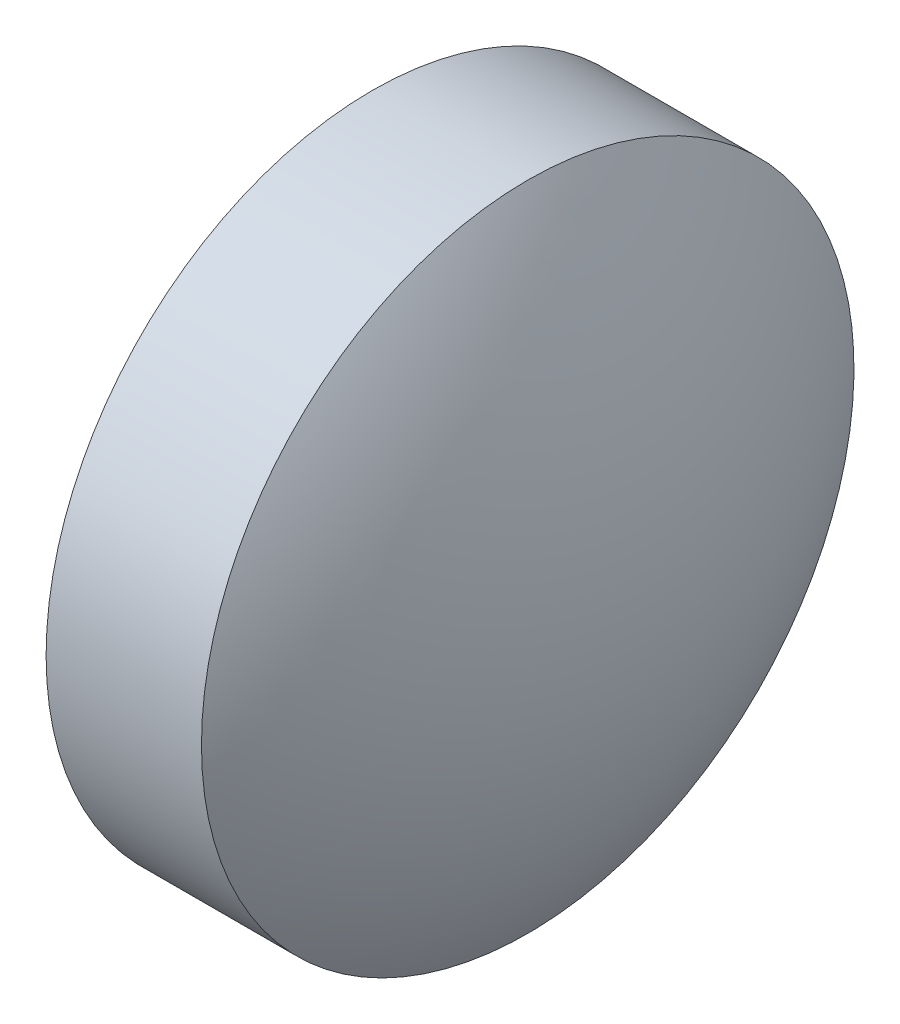
ISO-10303-21;
HEADER;
FILE_DESCRIPTION(('STEP AP214'),'2;1');
FILE_NAME('part.step','',(''),(''),'','','');
FILE_SCHEMA(('AUTOMOTIVE_DESIGN { 1 0 10303 214 1 1 1 1 }'));
ENDSEC;
DATA;
#1=APPLICATION_CONTEXT('core data for automotive mechanical design processes');
#2=APPLICATION_PROTOCOL_DEFINITION('international standard','automotive_design',2000,#1);
#3=PRODUCT_CONTEXT('',#1,'mechanical');
#4=PRODUCT('Part','Part','',(#3));
#5=PRODUCT_RELATED_PRODUCT_CATEGORY('part','',(#4));
#6=PRODUCT_DEFINITION_FORMATION('','',#4);
#7=PRODUCT_DEFINITION_CONTEXT('part definition',#1,'design');
#8=PRODUCT_DEFINITION('design','',#6,#7);
#9=PRODUCT_DEFINITION_SHAPE('','',#8);
#10=(LENGTH_UNIT() NAMED_UNIT(*) SI_UNIT(.MILLI.,.METRE.));
#11=(NAMED_UNIT(*) PLANE_ANGLE_UNIT() SI_UNIT($,.RADIAN.));
#12=(NAMED_UNIT(*) SI_UNIT($,.STERADIAN.) SOLID_ANGLE_UNIT());
#13=UNCERTAINTY_MEASURE_WITH_UNIT(LENGTH_MEASURE(1.E-05),#10,'distance_accuracy_value','');
#14=(GEOMETRIC_REPRESENTATION_CONTEXT(3) GLOBAL_UNCERTAINTY_ASSIGNED_CONTEXT((#13)) GLOBAL_UNIT_ASSIGNED_CONTEXT((#10,
#11,#12)) REPRESENTATION_CONTEXT('',''));
#15=CARTESIAN_POINT('',(0.,0.,0.));
#16=DIRECTION('',(0.,0.,1.));
#17=DIRECTION('',(1.,0.,0.));
#18=AXIS2_PLACEMENT_3D('',#15,#16,#17);
#19=CARTESIAN_POINT('',(25.635314013953,12.0583754794099,0.));
#20=DIRECTION('',(-1.,0.,0.));
#21=DIRECTION('',(0.,1.,0.));
#22=AXIS2_PLACEMENT_3D('',#19,#20,#21);
#23=SPHERICAL_SURFACE('',#22,5.85959096233107);
#24=CARTESIAN_POINT('',(20.6944409265973,12.0583754794099,0.));
#25=DIRECTION('',(-1.,0.,0.));
#26=DIRECTION('',(0.,0.,1.));
#27=AXIS2_PLACEMENT_3D('',#24,#25,#26);
#28=CIRCLE('',#27,3.15001260005039);
#29=CARTESIAN_POINT('',(20.6944409265973,12.0583754794099,3.15001260005039));
#30=VERTEX_POINT('',#29);
#31=EDGE_CURVE('E41',#30,#30,#28,.T.);
#32=ORIENTED_EDGE('',*,*,#31,.T.);
#33=EDGE_LOOP('',(#32));
#34=FACE_BOUND('',#33,.T.);
#35=ADVANCED_FACE('F35',(#34),#23,.T.);
#36=CARTESIAN_POINT('',(17.2535678392415,12.0583754794099,0.));
#37=DIRECTION('',(-1.,0.,0.));
#38=DIRECTION('',(0.,1.,0.));
#39=AXIS2_PLACEMENT_3D('',#36,#37,#38);
#40=SPHERICAL_SURFACE('',#39,5.85959096233111);
#41=CARTESIAN_POINT('',(22.1944409265973,12.0583754794099,0.));
#42=DIRECTION('',(-1.,0.,0.));
#43=DIRECTION('',(0.,0.,1.));
#44=AXIS2_PLACEMENT_3D('',#41,#42,#43);
#45=CIRCLE('',#44,3.15001260005039);
#46=CARTESIAN_POINT('',(22.1944409265973,12.0583754794099,3.15001260005039));
#47=VERTEX_POINT('',#46);
#48=EDGE_CURVE('E10',#47,#47,#45,.T.);
#49=ORIENTED_EDGE('',*,*,#48,.F.);
#50=EDGE_LOOP('',(#49));
#51=FACE_BOUND('',#50,.T.);
#52=ADVANCED_FACE('F50',(#51),#40,.T.);
#53=CARTESIAN_POINT('',(18.2647680982035,12.0583754794099,0.));
#54=DIRECTION('',(-1.,0.,0.));
#55=DIRECTION('',(0.,0.,1.));
#56=AXIS2_PLACEMENT_3D('',#53,#54,#55);
#57=CYLINDRICAL_SURFACE('',#56,3.15001260005039);
#58=ORIENTED_EDGE('',*,*,#48,.T.);
#59=EDGE_LOOP('',(#58));
#60=FACE_BOUND('',#59,.T.);
#61=ORIENTED_EDGE('',*,*,#31,.F.);
#62=EDGE_LOOP('',(#61));
#63=FACE_BOUND('',#62,.T.);
#64=ADVANCED_FACE('F48',(#60,#63),#57,.T.);
#65=CLOSED_SHELL('',(#35,#52,#64));
#66=MANIFOLD_SOLID_BREP('B2',#65);
#67=ADVANCED_BREP_SHAPE_REPRESENTATION('',(#18,#66),#14);
#68=SHAPE_DEFINITION_REPRESENTATION(#9,#67);
ENDSEC;
END-ISO-10303-21;
